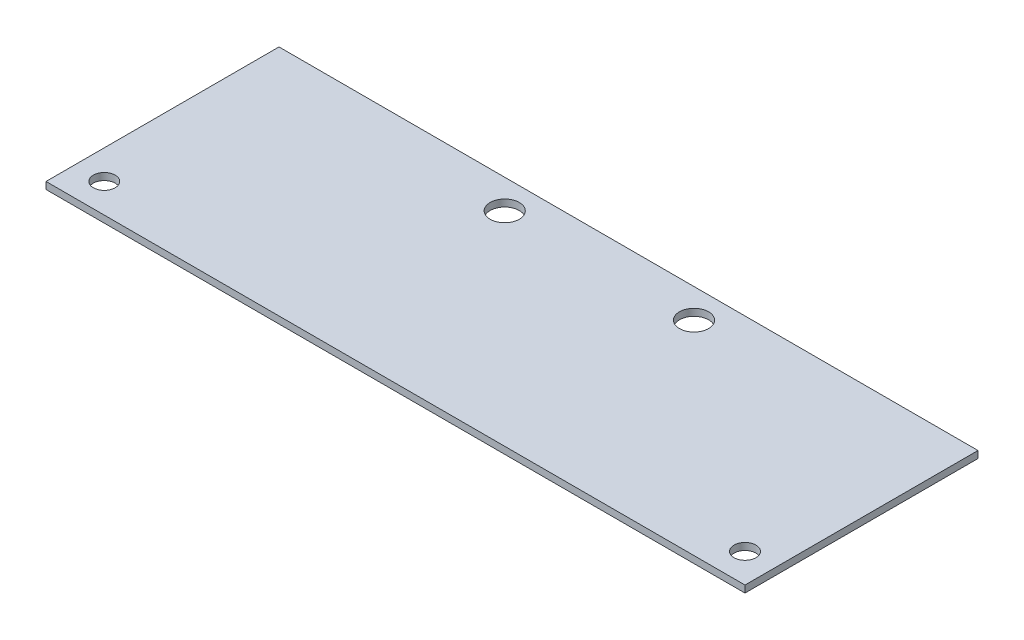
ISO-10303-21;
HEADER;
FILE_DESCRIPTION(('STEP AP214'),'2;1');
FILE_NAME('part.step','',(''),(''),'','','');
FILE_SCHEMA(('AUTOMOTIVE_DESIGN { 1 0 10303 214 1 1 1 1 }'));
ENDSEC;
DATA;
#1=APPLICATION_CONTEXT('core data for automotive mechanical design processes');
#2=APPLICATION_PROTOCOL_DEFINITION('international standard','automotive_design',2000,#1);
#3=PRODUCT_CONTEXT('',#1,'mechanical');
#4=PRODUCT('Part','Part','',(#3));
#5=PRODUCT_RELATED_PRODUCT_CATEGORY('part','',(#4));
#6=PRODUCT_DEFINITION_FORMATION('','',#4);
#7=PRODUCT_DEFINITION_CONTEXT('part definition',#1,'design');
#8=PRODUCT_DEFINITION('design','',#6,#7);
#9=PRODUCT_DEFINITION_SHAPE('','',#8);
#10=(LENGTH_UNIT() NAMED_UNIT(*) SI_UNIT(.MILLI.,.METRE.));
#11=(NAMED_UNIT(*) PLANE_ANGLE_UNIT() SI_UNIT($,.RADIAN.));
#12=(NAMED_UNIT(*) SI_UNIT($,.STERADIAN.) SOLID_ANGLE_UNIT());
#13=UNCERTAINTY_MEASURE_WITH_UNIT(LENGTH_MEASURE(1.E-05),#10,'distance_accuracy_value','');
#14=(GEOMETRIC_REPRESENTATION_CONTEXT(3) GLOBAL_UNCERTAINTY_ASSIGNED_CONTEXT((#13)) GLOBAL_UNIT_ASSIGNED_CONTEXT((#10,
#11,#12)) REPRESENTATION_CONTEXT('',''));
#15=CARTESIAN_POINT('',(0.,0.,0.));
#16=DIRECTION('',(0.,0.,1.));
#17=DIRECTION('',(1.,0.,0.));
#18=AXIS2_PLACEMENT_3D('',#15,#16,#17);
#19=CARTESIAN_POINT('',(0.,1.524,0.));
#20=DIRECTION('',(0.,-1.,0.));
#21=DIRECTION('',(0.,0.,-1.));
#22=AXIS2_PLACEMENT_3D('',#19,#20,#21);
#23=PLANE('',#22);
#24=DIRECTION('',(0.,0.,1.));
#25=VECTOR('',#24,1.);
#26=CARTESIAN_POINT('',(0.,1.524,0.));
#27=LINE('',#26,#25);
#28=CARTESIAN_POINT('',(0.,1.524,-50.8));
#29=VERTEX_POINT('',#28);
#30=CARTESIAN_POINT('',(0.,1.524,0.));
#31=VERTEX_POINT('',#30);
#32=EDGE_CURVE('E98',#29,#31,#27,.T.);
#33=ORIENTED_EDGE('',*,*,#32,.T.);
#34=DIRECTION('',(1.,0.,0.));
#35=VECTOR('',#34,1.);
#36=CARTESIAN_POINT('',(0.,1.524,0.));
#37=LINE('',#36,#35);
#38=CARTESIAN_POINT('',(152.4,1.524,0.));
#39=VERTEX_POINT('',#38);
#40=EDGE_CURVE('E93',#31,#39,#37,.T.);
#41=ORIENTED_EDGE('',*,*,#40,.T.);
#42=DIRECTION('',(0.,0.,-1.));
#43=VECTOR('',#42,1.);
#44=CARTESIAN_POINT('',(152.4,1.524,0.));
#45=LINE('',#44,#43);
#46=CARTESIAN_POINT('',(152.4,1.524,-50.8));
#47=VERTEX_POINT('',#46);
#48=EDGE_CURVE('E96',#39,#47,#45,.T.);
#49=ORIENTED_EDGE('',*,*,#48,.T.);
#50=DIRECTION('',(-1.,0.,0.));
#51=VECTOR('',#50,1.);
#52=CARTESIAN_POINT('',(0.,1.524,-50.8));
#53=LINE('',#52,#51);
#54=EDGE_CURVE('E63',#47,#29,#53,.T.);
#55=ORIENTED_EDGE('',*,*,#54,.T.);
#56=EDGE_LOOP('',(#33,#41,#49,#55));
#57=FACE_BOUND('',#56,.T.);
#58=CARTESIAN_POINT('',(6.35,1.524,-6.35));
#59=DIRECTION('',(0.,1.,0.));
#60=DIRECTION('',(0.,0.,1.));
#61=AXIS2_PLACEMENT_3D('',#58,#59,#60);
#62=CIRCLE('',#61,2.3876);
#63=CARTESIAN_POINT('',(6.35,1.524,-3.9624));
#64=VERTEX_POINT('',#63);
#65=EDGE_CURVE('E118',#64,#64,#62,.T.);
#66=ORIENTED_EDGE('',*,*,#65,.F.);
#67=EDGE_LOOP('',(#66));
#68=FACE_BOUND('',#67,.T.);
#69=CARTESIAN_POINT('',(55.5625,1.524,-44.45));
#70=DIRECTION('',(0.,1.,0.));
#71=DIRECTION('',(0.,0.,1.));
#72=AXIS2_PLACEMENT_3D('',#69,#70,#71);
#73=CIRCLE('',#72,3.17500000000001);
#74=CARTESIAN_POINT('',(55.5625,1.524,-41.275));
#75=VERTEX_POINT('',#74);
#76=EDGE_CURVE('E140',#75,#75,#73,.T.);
#77=ORIENTED_EDGE('',*,*,#76,.F.);
#78=EDGE_LOOP('',(#77));
#79=FACE_BOUND('',#78,.T.);
#80=CARTESIAN_POINT('',(146.05,1.524,-6.35));
#81=DIRECTION('',(0.,1.,0.));
#82=DIRECTION('',(0.,0.,1.));
#83=AXIS2_PLACEMENT_3D('',#80,#81,#82);
#84=CIRCLE('',#83,2.38759999999999);
#85=CARTESIAN_POINT('',(146.05,1.524,-3.96240000000001));
#86=VERTEX_POINT('',#85);
#87=EDGE_CURVE('E148',#86,#86,#84,.T.);
#88=ORIENTED_EDGE('',*,*,#87,.F.);
#89=EDGE_LOOP('',(#88));
#90=FACE_BOUND('',#89,.T.);
#91=CARTESIAN_POINT('',(96.8375,1.524,-44.45));
#92=DIRECTION('',(0.,1.,0.));
#93=DIRECTION('',(0.,0.,1.));
#94=AXIS2_PLACEMENT_3D('',#91,#92,#93);
#95=CIRCLE('',#94,3.175);
#96=CARTESIAN_POINT('',(96.8375,1.524,-41.275));
#97=VERTEX_POINT('',#96);
#98=EDGE_CURVE('E156',#97,#97,#95,.T.);
#99=ORIENTED_EDGE('',*,*,#98,.F.);
#100=EDGE_LOOP('',(#99));
#101=FACE_BOUND('',#100,.T.);
#102=ADVANCED_FACE('F45',(#57,#68,#79,#90,#101),#23,.F.);
#103=CARTESIAN_POINT('',(0.,0.,0.));
#104=DIRECTION('',(0.,-1.,0.));
#105=DIRECTION('',(0.,0.,-1.));
#106=AXIS2_PLACEMENT_3D('',#103,#104,#105);
#107=PLANE('',#106);
#108=CARTESIAN_POINT('',(146.05,0.,-6.35));
#109=DIRECTION('',(0.,1.,0.));
#110=DIRECTION('',(0.,0.,1.));
#111=AXIS2_PLACEMENT_3D('',#108,#109,#110);
#112=CIRCLE('',#111,2.38759999999999);
#113=CARTESIAN_POINT('',(146.05,0.,-3.96240000000001));
#114=VERTEX_POINT('',#113);
#115=EDGE_CURVE('E152',#114,#114,#112,.T.);
#116=ORIENTED_EDGE('',*,*,#115,.T.);
#117=EDGE_LOOP('',(#116));
#118=FACE_BOUND('',#117,.T.);
#119=CARTESIAN_POINT('',(6.35,0.,-6.35));
#120=DIRECTION('',(0.,1.,0.));
#121=DIRECTION('',(0.,0.,1.));
#122=AXIS2_PLACEMENT_3D('',#119,#120,#121);
#123=CIRCLE('',#122,2.3876);
#124=CARTESIAN_POINT('',(6.35,0.,-3.9624));
#125=VERTEX_POINT('',#124);
#126=EDGE_CURVE('E136',#125,#125,#123,.T.);
#127=ORIENTED_EDGE('',*,*,#126,.T.);
#128=EDGE_LOOP('',(#127));
#129=FACE_BOUND('',#128,.T.);
#130=DIRECTION('',(0.,0.,1.));
#131=VECTOR('',#130,1.);
#132=CARTESIAN_POINT('',(0.,0.,0.));
#133=LINE('',#132,#131);
#134=CARTESIAN_POINT('',(0.,0.,-50.8));
#135=VERTEX_POINT('',#134);
#136=CARTESIAN_POINT('',(0.,0.,0.));
#137=VERTEX_POINT('',#136);
#138=EDGE_CURVE('E114',#135,#137,#133,.T.);
#139=ORIENTED_EDGE('',*,*,#138,.F.);
#140=DIRECTION('',(-1.,0.,0.));
#141=VECTOR('',#140,1.);
#142=CARTESIAN_POINT('',(0.,0.,-50.8));
#143=LINE('',#142,#141);
#144=CARTESIAN_POINT('',(152.4,0.,-50.8));
#145=VERTEX_POINT('',#144);
#146=EDGE_CURVE('E86',#145,#135,#143,.T.);
#147=ORIENTED_EDGE('',*,*,#146,.F.);
#148=DIRECTION('',(0.,0.,-1.));
#149=VECTOR('',#148,1.);
#150=CARTESIAN_POINT('',(152.4,0.,0.));
#151=LINE('',#150,#149);
#152=CARTESIAN_POINT('',(152.4,0.,0.));
#153=VERTEX_POINT('',#152);
#154=EDGE_CURVE('E80',#153,#145,#151,.T.);
#155=ORIENTED_EDGE('',*,*,#154,.F.);
#156=DIRECTION('',(1.,0.,0.));
#157=VECTOR('',#156,1.);
#158=CARTESIAN_POINT('',(0.,0.,0.));
#159=LINE('',#158,#157);
#160=EDGE_CURVE('E103',#137,#153,#159,.T.);
#161=ORIENTED_EDGE('',*,*,#160,.F.);
#162=EDGE_LOOP('',(#139,#147,#155,#161));
#163=FACE_BOUND('',#162,.T.);
#164=CARTESIAN_POINT('',(55.5625,0.,-44.45));
#165=DIRECTION('',(0.,1.,0.));
#166=DIRECTION('',(0.,0.,1.));
#167=AXIS2_PLACEMENT_3D('',#164,#165,#166);
#168=CIRCLE('',#167,3.17500000000001);
#169=CARTESIAN_POINT('',(55.5625,0.,-41.275));
#170=VERTEX_POINT('',#169);
#171=EDGE_CURVE('E144',#170,#170,#168,.T.);
#172=ORIENTED_EDGE('',*,*,#171,.T.);
#173=EDGE_LOOP('',(#172));
#174=FACE_BOUND('',#173,.T.);
#175=CARTESIAN_POINT('',(96.8375,0.,-44.45));
#176=DIRECTION('',(0.,1.,0.));
#177=DIRECTION('',(0.,0.,1.));
#178=AXIS2_PLACEMENT_3D('',#175,#176,#177);
#179=CIRCLE('',#178,3.175);
#180=CARTESIAN_POINT('',(96.8375,0.,-41.275));
#181=VERTEX_POINT('',#180);
#182=EDGE_CURVE('E160',#181,#181,#179,.T.);
#183=ORIENTED_EDGE('',*,*,#182,.T.);
#184=EDGE_LOOP('',(#183));
#185=FACE_BOUND('',#184,.T.);
#186=ADVANCED_FACE('F131',(#118,#129,#163,#174,#185),#107,.T.);
#187=CARTESIAN_POINT('',(0.,1.524,0.));
#188=DIRECTION('',(1.,0.,0.));
#189=DIRECTION('',(0.,0.,-1.));
#190=AXIS2_PLACEMENT_3D('',#187,#188,#189);
#191=PLANE('',#190);
#192=ORIENTED_EDGE('',*,*,#138,.T.);
#193=DIRECTION('',(0.,-1.,0.));
#194=VECTOR('',#193,1.);
#195=CARTESIAN_POINT('',(0.,1.524,0.));
#196=LINE('',#195,#194);
#197=EDGE_CURVE('E11',#31,#137,#196,.T.);
#198=ORIENTED_EDGE('',*,*,#197,.F.);
#199=ORIENTED_EDGE('',*,*,#32,.F.);
#200=DIRECTION('',(0.,-1.,0.));
#201=VECTOR('',#200,1.);
#202=CARTESIAN_POINT('',(0.,1.524,-50.8));
#203=LINE('',#202,#201);
#204=EDGE_CURVE('E110',#29,#135,#203,.T.);
#205=ORIENTED_EDGE('',*,*,#204,.T.);
#206=EDGE_LOOP('',(#192,#198,#199,#205));
#207=FACE_BOUND('',#206,.T.);
#208=ADVANCED_FACE('F47',(#207),#191,.F.);
#209=CARTESIAN_POINT('',(0.,1.524,0.));
#210=DIRECTION('',(0.,0.,-1.));
#211=DIRECTION('',(-1.,0.,0.));
#212=AXIS2_PLACEMENT_3D('',#209,#210,#211);
#213=PLANE('',#212);
#214=ORIENTED_EDGE('',*,*,#160,.T.);
#215=DIRECTION('',(0.,-1.,0.));
#216=VECTOR('',#215,1.);
#217=CARTESIAN_POINT('',(152.4,1.524,0.));
#218=LINE('',#217,#216);
#219=EDGE_CURVE('E55',#39,#153,#218,.T.);
#220=ORIENTED_EDGE('',*,*,#219,.F.);
#221=ORIENTED_EDGE('',*,*,#40,.F.);
#222=ORIENTED_EDGE('',*,*,#197,.T.);
#223=EDGE_LOOP('',(#214,#220,#221,#222));
#224=FACE_BOUND('',#223,.T.);
#225=ADVANCED_FACE('F102',(#224),#213,.F.);
#226=CARTESIAN_POINT('',(152.4,1.524,0.));
#227=DIRECTION('',(-1.,0.,0.));
#228=DIRECTION('',(0.,0.,1.));
#229=AXIS2_PLACEMENT_3D('',#226,#227,#228);
#230=PLANE('',#229);
#231=ORIENTED_EDGE('',*,*,#154,.T.);
#232=DIRECTION('',(0.,-1.,0.));
#233=VECTOR('',#232,1.);
#234=CARTESIAN_POINT('',(152.4,1.524,-50.8));
#235=LINE('',#234,#233);
#236=EDGE_CURVE('E105',#47,#145,#235,.T.);
#237=ORIENTED_EDGE('',*,*,#236,.F.);
#238=ORIENTED_EDGE('',*,*,#48,.F.);
#239=ORIENTED_EDGE('',*,*,#219,.T.);
#240=EDGE_LOOP('',(#231,#237,#238,#239));
#241=FACE_BOUND('',#240,.T.);
#242=ADVANCED_FACE('F106',(#241),#230,.F.);
#243=CARTESIAN_POINT('',(0.,1.524,-50.8));
#244=DIRECTION('',(0.,0.,1.));
#245=DIRECTION('',(1.,0.,0.));
#246=AXIS2_PLACEMENT_3D('',#243,#244,#245);
#247=PLANE('',#246);
#248=ORIENTED_EDGE('',*,*,#146,.T.);
#249=ORIENTED_EDGE('',*,*,#204,.F.);
#250=ORIENTED_EDGE('',*,*,#54,.F.);
#251=ORIENTED_EDGE('',*,*,#236,.T.);
#252=EDGE_LOOP('',(#248,#249,#250,#251));
#253=FACE_BOUND('',#252,.T.);
#254=ADVANCED_FACE('F128',(#253),#247,.F.);
#255=CARTESIAN_POINT('',(6.35,1.524,-6.35));
#256=DIRECTION('',(0.,-1.,0.));
#257=DIRECTION('',(0.,0.,-1.));
#258=AXIS2_PLACEMENT_3D('',#255,#256,#257);
#259=CYLINDRICAL_SURFACE('',#258,2.3876);
#260=ORIENTED_EDGE('',*,*,#65,.T.);
#261=EDGE_LOOP('',(#260));
#262=FACE_BOUND('',#261,.T.);
#263=ORIENTED_EDGE('',*,*,#126,.F.);
#264=EDGE_LOOP('',(#263));
#265=FACE_BOUND('',#264,.T.);
#266=ADVANCED_FACE('F179',(#262,#265),#259,.F.);
#267=CARTESIAN_POINT('',(55.5625,1.524,-44.45));
#268=DIRECTION('',(0.,-1.,0.));
#269=DIRECTION('',(0.,0.,-1.));
#270=AXIS2_PLACEMENT_3D('',#267,#268,#269);
#271=CYLINDRICAL_SURFACE('',#270,3.17500000000001);
#272=ORIENTED_EDGE('',*,*,#76,.T.);
#273=EDGE_LOOP('',(#272));
#274=FACE_BOUND('',#273,.T.);
#275=ORIENTED_EDGE('',*,*,#171,.F.);
#276=EDGE_LOOP('',(#275));
#277=FACE_BOUND('',#276,.T.);
#278=ADVANCED_FACE('F224',(#274,#277),#271,.F.);
#279=CARTESIAN_POINT('',(146.05,1.524,-6.35));
#280=DIRECTION('',(0.,-1.,0.));
#281=DIRECTION('',(0.,0.,-1.));
#282=AXIS2_PLACEMENT_3D('',#279,#280,#281);
#283=CYLINDRICAL_SURFACE('',#282,2.38759999999999);
#284=ORIENTED_EDGE('',*,*,#87,.T.);
#285=EDGE_LOOP('',(#284));
#286=FACE_BOUND('',#285,.T.);
#287=ORIENTED_EDGE('',*,*,#115,.F.);
#288=EDGE_LOOP('',(#287));
#289=FACE_BOUND('',#288,.T.);
#290=ADVANCED_FACE('F232',(#286,#289),#283,.F.);
#291=CARTESIAN_POINT('',(96.8375,1.524,-44.45));
#292=DIRECTION('',(0.,-1.,0.));
#293=DIRECTION('',(0.,0.,-1.));
#294=AXIS2_PLACEMENT_3D('',#291,#292,#293);
#295=CYLINDRICAL_SURFACE('',#294,3.175);
#296=ORIENTED_EDGE('',*,*,#98,.T.);
#297=EDGE_LOOP('',(#296));
#298=FACE_BOUND('',#297,.T.);
#299=ORIENTED_EDGE('',*,*,#182,.F.);
#300=EDGE_LOOP('',(#299));
#301=FACE_BOUND('',#300,.T.);
#302=ADVANCED_FACE('F168',(#298,#301),#295,.F.);
#303=CLOSED_SHELL('',(#102,#186,#208,#225,#242,#254,#266,#278,#290,#302));
#304=MANIFOLD_SOLID_BREP('B2',#303);
#305=ADVANCED_BREP_SHAPE_REPRESENTATION('',(#18,#304),#14);
#306=SHAPE_DEFINITION_REPRESENTATION(#9,#305);
ENDSEC;
END-ISO-10303-21;
